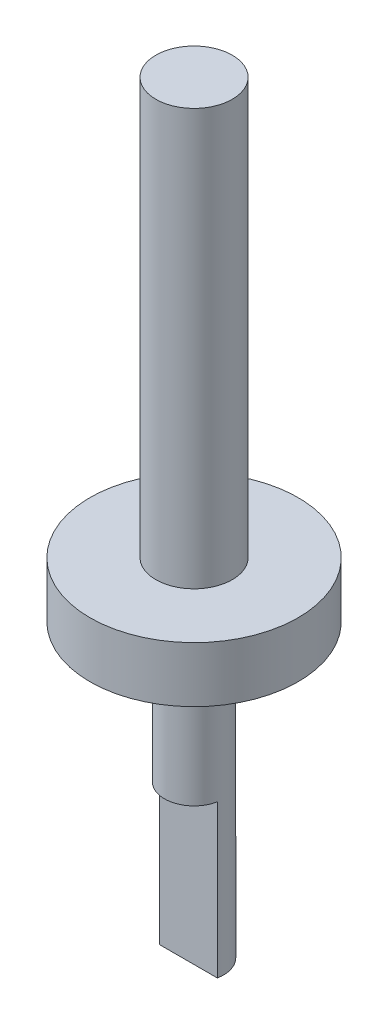
ISO-10303-21;
HEADER;
FILE_DESCRIPTION(('STEP AP214'),'2;1');
FILE_NAME('part.step','',(''),(''),'','','');
FILE_SCHEMA(('AUTOMOTIVE_DESIGN { 1 0 10303 214 1 1 1 1 }'));
ENDSEC;
DATA;
#1=APPLICATION_CONTEXT('core data for automotive mechanical design processes');
#2=APPLICATION_PROTOCOL_DEFINITION('international standard','automotive_design',2000,#1);
#3=PRODUCT_CONTEXT('',#1,'mechanical');
#4=PRODUCT('Part','Part','',(#3));
#5=PRODUCT_RELATED_PRODUCT_CATEGORY('part','',(#4));
#6=PRODUCT_DEFINITION_FORMATION('','',#4);
#7=PRODUCT_DEFINITION_CONTEXT('part definition',#1,'design');
#8=PRODUCT_DEFINITION('design','',#6,#7);
#9=PRODUCT_DEFINITION_SHAPE('','',#8);
#10=(LENGTH_UNIT() NAMED_UNIT(*) SI_UNIT(.MILLI.,.METRE.));
#11=(NAMED_UNIT(*) PLANE_ANGLE_UNIT() SI_UNIT($,.RADIAN.));
#12=(NAMED_UNIT(*) SI_UNIT($,.STERADIAN.) SOLID_ANGLE_UNIT());
#13=UNCERTAINTY_MEASURE_WITH_UNIT(LENGTH_MEASURE(1.E-05),#10,'distance_accuracy_value','');
#14=(GEOMETRIC_REPRESENTATION_CONTEXT(3) GLOBAL_UNCERTAINTY_ASSIGNED_CONTEXT((#13)) GLOBAL_UNIT_ASSIGNED_CONTEXT((#10,
#11,#12)) REPRESENTATION_CONTEXT('',''));
#15=CARTESIAN_POINT('',(0.,0.,0.));
#16=DIRECTION('',(0.,0.,1.));
#17=DIRECTION('',(1.,0.,0.));
#18=AXIS2_PLACEMENT_3D('',#15,#16,#17);
#19=CARTESIAN_POINT('',(0.,63.5,2.18279597836057));
#20=DIRECTION('',(0.,1.,0.));
#21=DIRECTION('',(0.,0.,1.));
#22=AXIS2_PLACEMENT_3D('',#19,#20,#21);
#23=PLANE('',#22);
#24=CARTESIAN_POINT('',(0.,63.5,2.18279597836057));
#25=DIRECTION('',(0.,1.,0.));
#26=DIRECTION('',(0.,0.,1.));
#27=AXIS2_PLACEMENT_3D('',#24,#25,#26);
#28=CIRCLE('',#27,19.065045150175);
#29=CARTESIAN_POINT('',(0.,63.5,21.2478411285356));
#30=VERTEX_POINT('',#29);
#31=EDGE_CURVE('E74',#30,#30,#28,.T.);
#32=ORIENTED_EDGE('',*,*,#31,.T.);
#33=EDGE_LOOP('',(#32));
#34=FACE_BOUND('',#33,.T.);
#35=CARTESIAN_POINT('',(0.,63.5,2.18279597836057));
#36=DIRECTION('',(0.,1.,0.));
#37=DIRECTION('',(0.,0.,1.));
#38=AXIS2_PLACEMENT_3D('',#35,#36,#37);
#39=CIRCLE('',#38,7.);
#40=CARTESIAN_POINT('',(0.,63.5,9.18279597836057));
#41=VERTEX_POINT('',#40);
#42=EDGE_CURVE('E128',#41,#41,#39,.T.);
#43=ORIENTED_EDGE('',*,*,#42,.F.);
#44=EDGE_LOOP('',(#43));
#45=FACE_BOUND('',#44,.T.);
#46=ADVANCED_FACE('F35',(#34,#45),#23,.T.);
#47=CARTESIAN_POINT('',(0.,27.94,2.18279597836057));
#48=DIRECTION('',(0.,-1.,0.));
#49=DIRECTION('',(0.,0.,-1.));
#50=AXIS2_PLACEMENT_3D('',#47,#48,#49);
#51=CYLINDRICAL_SURFACE('',#50,5.4);
#52=CARTESIAN_POINT('',(0.,0.,2.18279597836057));
#53=DIRECTION('',(0.,1.,0.));
#54=DIRECTION('',(0.,0.,-1.));
#55=AXIS2_PLACEMENT_3D('',#52,#53,#54);
#56=CIRCLE('',#55,5.4);
#57=CARTESIAN_POINT('',(5.3,0.,3.21720402163943));
#58=VERTEX_POINT('',#57);
#59=CARTESIAN_POINT('',(-5.3,0.,3.21720402163943));
#60=VERTEX_POINT('',#59);
#61=EDGE_CURVE('E77',#58,#60,#56,.T.);
#62=ORIENTED_EDGE('',*,*,#61,.T.);
#63=DIRECTION('',(0.,-1.,0.));
#64=VECTOR('',#63,1.);
#65=CARTESIAN_POINT('',(-5.3,27.94,3.21720402163943));
#66=LINE('',#65,#64);
#67=CARTESIAN_POINT('',(-5.3,27.94,3.21720402163943));
#68=VERTEX_POINT('',#67);
#69=EDGE_CURVE('E11',#68,#60,#66,.T.);
#70=ORIENTED_EDGE('',*,*,#69,.F.);
#71=CARTESIAN_POINT('',(0.,27.94,2.18279597836057));
#72=DIRECTION('',(0.,1.,0.));
#73=DIRECTION('',(0.,0.,1.));
#74=AXIS2_PLACEMENT_3D('',#71,#72,#73);
#75=CIRCLE('',#74,5.4);
#76=CARTESIAN_POINT('',(5.3,27.94,3.21720402163943));
#77=VERTEX_POINT('',#76);
#78=EDGE_CURVE('E70',#68,#77,#75,.T.);
#79=ORIENTED_EDGE('',*,*,#78,.T.);
#80=DIRECTION('',(0.,-1.,0.));
#81=VECTOR('',#80,1.);
#82=CARTESIAN_POINT('',(5.3,27.94,3.21720402163943));
#83=LINE('',#82,#81);
#84=EDGE_CURVE('E45',#77,#58,#83,.T.);
#85=ORIENTED_EDGE('',*,*,#84,.T.);
#86=EDGE_LOOP('',(#62,#70,#79,#85));
#87=FACE_BOUND('',#86,.T.);
#88=CARTESIAN_POINT('',(0.,53.34,2.18279597836057));
#89=DIRECTION('',(0.,1.,0.));
#90=DIRECTION('',(0.,0.,1.));
#91=AXIS2_PLACEMENT_3D('',#88,#89,#90);
#92=CIRCLE('',#91,5.4);
#93=CARTESIAN_POINT('',(0.,53.34,7.58279597836057));
#94=VERTEX_POINT('',#93);
#95=EDGE_CURVE('E73',#94,#94,#92,.T.);
#96=ORIENTED_EDGE('',*,*,#95,.F.);
#97=EDGE_LOOP('',(#96));
#98=FACE_BOUND('',#97,.T.);
#99=ADVANCED_FACE('F37',(#87,#98),#51,.T.);
#100=CARTESIAN_POINT('',(-5.3,27.94,3.21720402163943));
#101=DIRECTION('',(0.,0.,-1.));
#102=DIRECTION('',(-1.,0.,0.));
#103=AXIS2_PLACEMENT_3D('',#100,#101,#102);
#104=PLANE('',#103);
#105=DIRECTION('',(1.,0.,0.));
#106=VECTOR('',#105,1.);
#107=CARTESIAN_POINT('',(-5.3,0.,3.21720402163943));
#108=LINE('',#107,#106);
#109=EDGE_CURVE('E60',#60,#58,#108,.T.);
#110=ORIENTED_EDGE('',*,*,#109,.T.);
#111=ORIENTED_EDGE('',*,*,#84,.F.);
#112=DIRECTION('',(1.,0.,0.));
#113=VECTOR('',#112,1.);
#114=CARTESIAN_POINT('',(-5.3,27.94,3.21720402163943));
#115=LINE('',#114,#113);
#116=EDGE_CURVE('E51',#68,#77,#115,.T.);
#117=ORIENTED_EDGE('',*,*,#116,.F.);
#118=ORIENTED_EDGE('',*,*,#69,.T.);
#119=EDGE_LOOP('',(#110,#111,#117,#118));
#120=FACE_BOUND('',#119,.T.);
#121=ADVANCED_FACE('F62',(#120),#104,.F.);
#122=CARTESIAN_POINT('',(0.,0.,2.18279597836057));
#123=DIRECTION('',(0.,-1.,0.));
#124=DIRECTION('',(0.,0.,-1.));
#125=AXIS2_PLACEMENT_3D('',#122,#123,#124);
#126=PLANE('',#125);
#127=ORIENTED_EDGE('',*,*,#61,.F.);
#128=ORIENTED_EDGE('',*,*,#109,.F.);
#129=EDGE_LOOP('',(#127,#128));
#130=FACE_BOUND('',#129,.T.);
#131=ADVANCED_FACE('F90',(#130),#126,.T.);
#132=CARTESIAN_POINT('',(0.,27.94,0.));
#133=DIRECTION('',(0.,1.,0.));
#134=DIRECTION('',(0.,0.,1.));
#135=AXIS2_PLACEMENT_3D('',#132,#133,#134);
#136=PLANE('',#135);
#137=ORIENTED_EDGE('',*,*,#78,.F.);
#138=ORIENTED_EDGE('',*,*,#116,.T.);
#139=EDGE_LOOP('',(#137,#138));
#140=FACE_BOUND('',#139,.T.);
#141=ADVANCED_FACE('F69',(#140),#136,.F.);
#142=CARTESIAN_POINT('',(0.,53.34,2.18279597836057));
#143=DIRECTION('',(0.,1.,0.));
#144=DIRECTION('',(0.,0.,1.));
#145=AXIS2_PLACEMENT_3D('',#142,#143,#144);
#146=PLANE('',#145);
#147=CARTESIAN_POINT('',(0.,53.34,2.18279597836057));
#148=DIRECTION('',(0.,1.,0.));
#149=DIRECTION('',(0.,0.,1.));
#150=AXIS2_PLACEMENT_3D('',#147,#148,#149);
#151=CIRCLE('',#150,19.065045150175);
#152=CARTESIAN_POINT('',(0.,53.34,21.2478411285356));
#153=VERTEX_POINT('',#152);
#154=EDGE_CURVE('E80',#153,#153,#151,.T.);
#155=ORIENTED_EDGE('',*,*,#154,.F.);
#156=EDGE_LOOP('',(#155));
#157=FACE_BOUND('',#156,.T.);
#158=ORIENTED_EDGE('',*,*,#95,.T.);
#159=EDGE_LOOP('',(#158));
#160=FACE_BOUND('',#159,.T.);
#161=ADVANCED_FACE('F97',(#157,#160),#146,.F.);
#162=CARTESIAN_POINT('',(0.,63.5,2.18279597836057));
#163=DIRECTION('',(0.,-1.,0.));
#164=DIRECTION('',(0.,0.,-1.));
#165=AXIS2_PLACEMENT_3D('',#162,#163,#164);
#166=CYLINDRICAL_SURFACE('',#165,19.065045150175);
#167=ORIENTED_EDGE('',*,*,#31,.F.);
#168=EDGE_LOOP('',(#167));
#169=FACE_BOUND('',#168,.T.);
#170=ORIENTED_EDGE('',*,*,#154,.T.);
#171=EDGE_LOOP('',(#170));
#172=FACE_BOUND('',#171,.T.);
#173=ADVANCED_FACE('F112',(#169,#172),#166,.T.);
#174=CARTESIAN_POINT('',(0.,139.7,2.18279597836057));
#175=DIRECTION('',(0.,-1.,0.));
#176=DIRECTION('',(0.,0.,-1.));
#177=AXIS2_PLACEMENT_3D('',#174,#175,#176);
#178=CYLINDRICAL_SURFACE('',#177,7.);
#179=CARTESIAN_POINT('',(0.,139.7,2.18279597836057));
#180=DIRECTION('',(0.,1.,0.));
#181=DIRECTION('',(0.,0.,1.));
#182=AXIS2_PLACEMENT_3D('',#179,#180,#181);
#183=CIRCLE('',#182,7.);
#184=CARTESIAN_POINT('',(0.,139.7,9.18279597836057));
#185=VERTEX_POINT('',#184);
#186=EDGE_CURVE('E125',#185,#185,#183,.T.);
#187=ORIENTED_EDGE('',*,*,#186,.F.);
#188=EDGE_LOOP('',(#187));
#189=FACE_BOUND('',#188,.T.);
#190=ORIENTED_EDGE('',*,*,#42,.T.);
#191=EDGE_LOOP('',(#190));
#192=FACE_BOUND('',#191,.T.);
#193=ADVANCED_FACE('F108',(#189,#192),#178,.T.);
#194=CARTESIAN_POINT('',(0.,139.7,2.18279597836057));
#195=DIRECTION('',(0.,1.,0.));
#196=DIRECTION('',(0.,0.,1.));
#197=AXIS2_PLACEMENT_3D('',#194,#195,#196);
#198=PLANE('',#197);
#199=ORIENTED_EDGE('',*,*,#186,.T.);
#200=EDGE_LOOP('',(#199));
#201=FACE_BOUND('',#200,.T.);
#202=ADVANCED_FACE('F119',(#201),#198,.T.);
#203=CLOSED_SHELL('',(#46,#99,#121,#131,#141,#161,#173,#193,#202));
#204=MANIFOLD_SOLID_BREP('B2',#203);
#205=ADVANCED_BREP_SHAPE_REPRESENTATION('',(#18,#204),#14);
#206=SHAPE_DEFINITION_REPRESENTATION(#9,#205);
ENDSEC;
END-ISO-10303-21;
